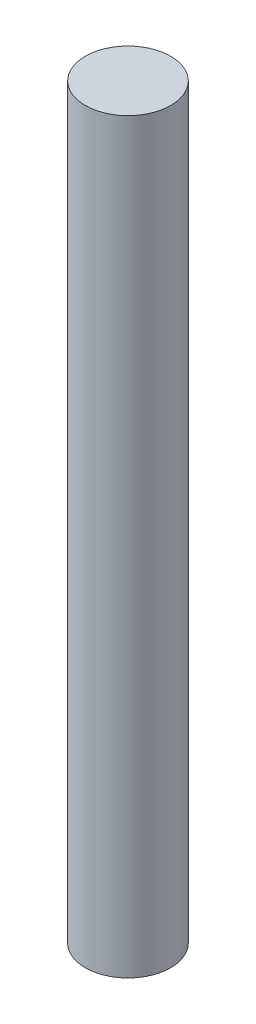
ISO-10303-21;
HEADER;
FILE_DESCRIPTION(('STEP AP214'),'2;1');
FILE_NAME('part.step','',(''),(''),'','','');
FILE_SCHEMA(('AUTOMOTIVE_DESIGN { 1 0 10303 214 1 1 1 1 }'));
ENDSEC;
DATA;
#1=APPLICATION_CONTEXT('core data for automotive mechanical design processes');
#2=APPLICATION_PROTOCOL_DEFINITION('international standard','automotive_design',2000,#1);
#3=PRODUCT_CONTEXT('',#1,'mechanical');
#4=PRODUCT('Part','Part','',(#3));
#5=PRODUCT_RELATED_PRODUCT_CATEGORY('part','',(#4));
#6=PRODUCT_DEFINITION_FORMATION('','',#4);
#7=PRODUCT_DEFINITION_CONTEXT('part definition',#1,'design');
#8=PRODUCT_DEFINITION('design','',#6,#7);
#9=PRODUCT_DEFINITION_SHAPE('','',#8);
#10=(LENGTH_UNIT() NAMED_UNIT(*) SI_UNIT(.MILLI.,.METRE.));
#11=(NAMED_UNIT(*) PLANE_ANGLE_UNIT() SI_UNIT($,.RADIAN.));
#12=(NAMED_UNIT(*) SI_UNIT($,.STERADIAN.) SOLID_ANGLE_UNIT());
#13=UNCERTAINTY_MEASURE_WITH_UNIT(LENGTH_MEASURE(1.E-05),#10,'distance_accuracy_value','');
#14=(GEOMETRIC_REPRESENTATION_CONTEXT(3) GLOBAL_UNCERTAINTY_ASSIGNED_CONTEXT((#13)) GLOBAL_UNIT_ASSIGNED_CONTEXT((#10,
#11,#12)) REPRESENTATION_CONTEXT('',''));
#15=CARTESIAN_POINT('',(0.,0.,0.));
#16=DIRECTION('',(0.,0.,1.));
#17=DIRECTION('',(1.,0.,0.));
#18=AXIS2_PLACEMENT_3D('',#15,#16,#17);
#19=CARTESIAN_POINT('',(0.,70.,0.));
#20=DIRECTION('',(0.,-1.,0.));
#21=DIRECTION('',(0.,0.,-1.));
#22=AXIS2_PLACEMENT_3D('',#19,#20,#21);
#23=CYLINDRICAL_SURFACE('',#22,4.);
#24=CARTESIAN_POINT('',(0.,70.,0.));
#25=DIRECTION('',(0.,1.,0.));
#26=DIRECTION('',(0.,0.,1.));
#27=AXIS2_PLACEMENT_3D('',#24,#25,#26);
#28=CIRCLE('',#27,4.);
#29=CARTESIAN_POINT('',(0.,70.,4.));
#30=VERTEX_POINT('',#29);
#31=EDGE_CURVE('E10',#30,#30,#28,.T.);
#32=ORIENTED_EDGE('',*,*,#31,.F.);
#33=EDGE_LOOP('',(#32));
#34=FACE_BOUND('',#33,.T.);
#35=CARTESIAN_POINT('',(0.,0.,0.));
#36=DIRECTION('',(0.,1.,0.));
#37=DIRECTION('',(0.,0.,1.));
#38=AXIS2_PLACEMENT_3D('',#35,#36,#37);
#39=CIRCLE('',#38,4.);
#40=CARTESIAN_POINT('',(0.,0.,4.));
#41=VERTEX_POINT('',#40);
#42=EDGE_CURVE('E40',#41,#41,#39,.T.);
#43=ORIENTED_EDGE('',*,*,#42,.T.);
#44=EDGE_LOOP('',(#43));
#45=FACE_BOUND('',#44,.T.);
#46=ADVANCED_FACE('F37',(#34,#45),#23,.T.);
#47=CARTESIAN_POINT('',(0.,70.,0.));
#48=DIRECTION('',(0.,1.,0.));
#49=DIRECTION('',(0.,0.,1.));
#50=AXIS2_PLACEMENT_3D('',#47,#48,#49);
#51=PLANE('',#50);
#52=ORIENTED_EDGE('',*,*,#31,.T.);
#53=EDGE_LOOP('',(#52));
#54=FACE_BOUND('',#53,.T.);
#55=ADVANCED_FACE('F54',(#54),#51,.T.);
#56=CARTESIAN_POINT('',(0.,0.,0.));
#57=DIRECTION('',(0.,1.,0.));
#58=DIRECTION('',(0.,0.,1.));
#59=AXIS2_PLACEMENT_3D('',#56,#57,#58);
#60=PLANE('',#59);
#61=ORIENTED_EDGE('',*,*,#42,.F.);
#62=EDGE_LOOP('',(#61));
#63=FACE_BOUND('',#62,.T.);
#64=ADVANCED_FACE('F52',(#63),#60,.F.);
#65=CLOSED_SHELL('',(#46,#55,#64));
#66=MANIFOLD_SOLID_BREP('B2',#65);
#67=ADVANCED_BREP_SHAPE_REPRESENTATION('',(#18,#66),#14);
#68=SHAPE_DEFINITION_REPRESENTATION(#9,#67);
ENDSEC;
END-ISO-10303-21;
